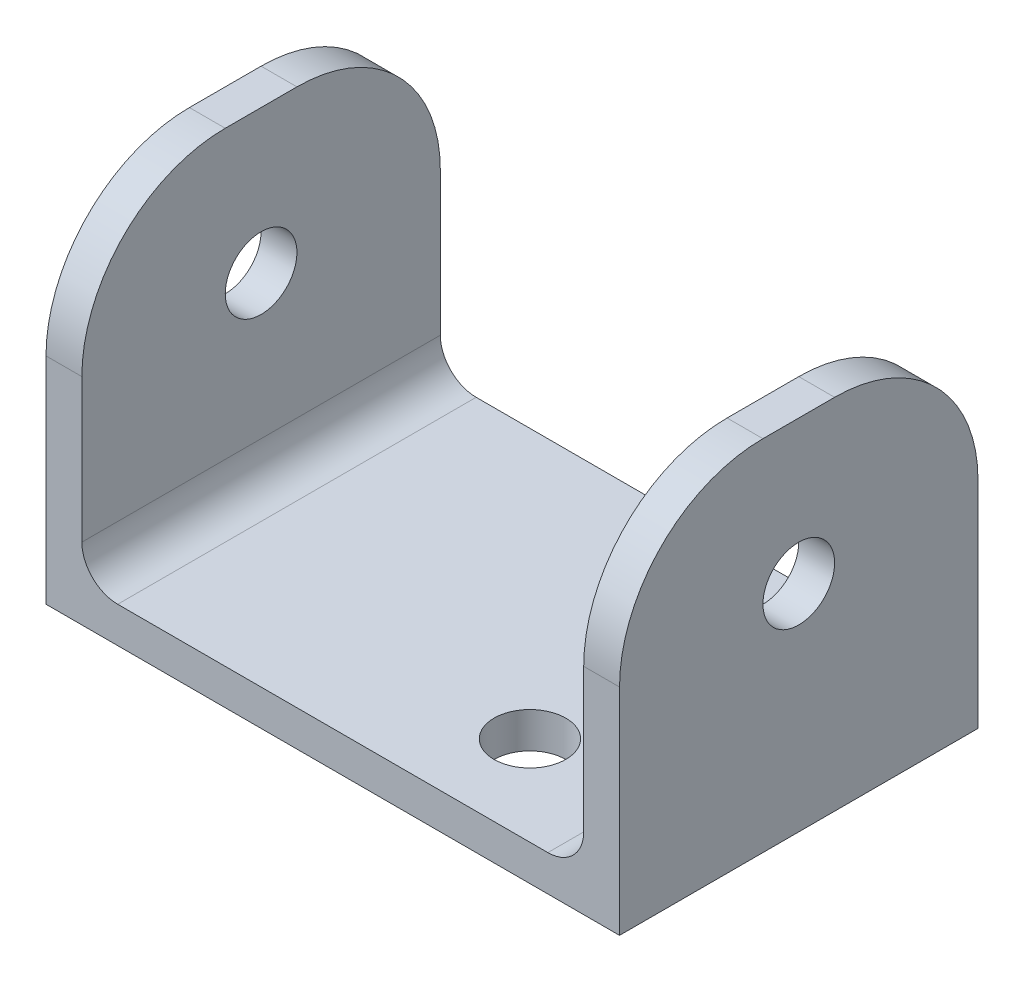
ISO-10303-21;
HEADER;
FILE_DESCRIPTION(('STEP AP214'),'2;1');
FILE_NAME('part.step','',(''),(''),'','','');
FILE_SCHEMA(('AUTOMOTIVE_DESIGN { 1 0 10303 214 1 1 1 1 }'));
ENDSEC;
DATA;
#1=APPLICATION_CONTEXT('core data for automotive mechanical design processes');
#2=APPLICATION_PROTOCOL_DEFINITION('international standard','automotive_design',2000,#1);
#3=PRODUCT_CONTEXT('',#1,'mechanical');
#4=PRODUCT('Part','Part','',(#3));
#5=PRODUCT_RELATED_PRODUCT_CATEGORY('part','',(#4));
#6=PRODUCT_DEFINITION_FORMATION('','',#4);
#7=PRODUCT_DEFINITION_CONTEXT('part definition',#1,'design');
#8=PRODUCT_DEFINITION('design','',#6,#7);
#9=PRODUCT_DEFINITION_SHAPE('','',#8);
#10=(LENGTH_UNIT() NAMED_UNIT(*) SI_UNIT(.MILLI.,.METRE.));
#11=(NAMED_UNIT(*) PLANE_ANGLE_UNIT() SI_UNIT($,.RADIAN.));
#12=(NAMED_UNIT(*) SI_UNIT($,.STERADIAN.) SOLID_ANGLE_UNIT());
#13=UNCERTAINTY_MEASURE_WITH_UNIT(LENGTH_MEASURE(1.E-05),#10,'distance_accuracy_value','');
#14=(GEOMETRIC_REPRESENTATION_CONTEXT(3) GLOBAL_UNCERTAINTY_ASSIGNED_CONTEXT((#13)) GLOBAL_UNIT_ASSIGNED_CONTEXT((#10,
#11,#12)) REPRESENTATION_CONTEXT('',''));
#15=CARTESIAN_POINT('',(0.,0.,0.));
#16=DIRECTION('',(0.,0.,1.));
#17=DIRECTION('',(1.,0.,0.));
#18=AXIS2_PLACEMENT_3D('',#15,#16,#17);
#19=CARTESIAN_POINT('',(-25.4,15.875,15.875));
#20=DIRECTION('',(0.,-1.,0.));
#21=DIRECTION('',(0.,0.,-1.));
#22=AXIS2_PLACEMENT_3D('',#19,#20,#21);
#23=PLANE('',#22);
#24=DIRECTION('',(0.,0.,-1.));
#25=VECTOR('',#24,1.);
#26=CARTESIAN_POINT('',(-25.4,15.875,15.875));
#27=LINE('',#26,#25);
#28=CARTESIAN_POINT('',(-25.4,15.875,3.175));
#29=VERTEX_POINT('',#28);
#30=CARTESIAN_POINT('',(-25.4,15.875,-3.175));
#31=VERTEX_POINT('',#30);
#32=EDGE_CURVE('E158',#29,#31,#27,.T.);
#33=ORIENTED_EDGE('',*,*,#32,.F.);
#34=DIRECTION('',(-1.,0.,0.));
#35=VECTOR('',#34,1.);
#36=CARTESIAN_POINT('',(-22.225,15.875,3.175));
#37=LINE('',#36,#35);
#38=CARTESIAN_POINT('',(-22.225,15.875,3.175));
#39=VERTEX_POINT('',#38);
#40=EDGE_CURVE('E214',#29,#39,#37,.F.);
#41=ORIENTED_EDGE('',*,*,#40,.T.);
#42=DIRECTION('',(0.,0.,1.));
#43=VECTOR('',#42,1.);
#44=CARTESIAN_POINT('',(-22.225,15.875,-15.875));
#45=LINE('',#44,#43);
#46=CARTESIAN_POINT('',(-22.225,15.875,-3.175));
#47=VERTEX_POINT('',#46);
#48=EDGE_CURVE('E170',#47,#39,#45,.T.);
#49=ORIENTED_EDGE('',*,*,#48,.F.);
#50=DIRECTION('',(-1.,0.,0.));
#51=VECTOR('',#50,1.);
#52=CARTESIAN_POINT('',(-25.4,15.875,-3.175));
#53=LINE('',#52,#51);
#54=EDGE_CURVE('E211',#47,#31,#53,.T.);
#55=ORIENTED_EDGE('',*,*,#54,.T.);
#56=EDGE_LOOP('',(#33,#41,#49,#55));
#57=FACE_BOUND('',#56,.T.);
#58=ADVANCED_FACE('F37',(#57),#23,.F.);
#59=CARTESIAN_POINT('',(25.4,15.875,15.875));
#60=DIRECTION('',(-1.,0.,0.));
#61=DIRECTION('',(0.,0.,1.));
#62=AXIS2_PLACEMENT_3D('',#59,#60,#61);
#63=PLANE('',#62);
#64=CARTESIAN_POINT('',(25.4,3.17500000000001,0.));
#65=DIRECTION('',(1.,0.,0.));
#66=DIRECTION('',(0.,1.,0.));
#67=AXIS2_PLACEMENT_3D('',#64,#65,#66);
#68=CIRCLE('',#67,3.175);
#69=CARTESIAN_POINT('',(25.4,6.35000000000001,0.));
#70=VERTEX_POINT('',#69);
#71=EDGE_CURVE('E276',#70,#70,#68,.T.);
#72=ORIENTED_EDGE('',*,*,#71,.F.);
#73=EDGE_LOOP('',(#72));
#74=FACE_BOUND('',#73,.T.);
#75=DIRECTION('',(0.,1.,0.));
#76=VECTOR('',#75,1.);
#77=CARTESIAN_POINT('',(25.4,15.875,-15.875));
#78=LINE('',#77,#76);
#79=CARTESIAN_POINT('',(25.4,-15.875,-15.875));
#80=VERTEX_POINT('',#79);
#81=CARTESIAN_POINT('',(25.4,3.175,-15.875));
#82=VERTEX_POINT('',#81);
#83=EDGE_CURVE('E168',#80,#82,#78,.T.);
#84=ORIENTED_EDGE('',*,*,#83,.T.);
#85=CARTESIAN_POINT('',(25.4,3.175,-3.175));
#86=DIRECTION('',(-1.,0.,0.));
#87=DIRECTION('',(0.,0.,1.));
#88=AXIS2_PLACEMENT_3D('',#85,#86,#87);
#89=CIRCLE('',#88,12.7);
#90=CARTESIAN_POINT('',(25.4,15.875,-3.175));
#91=VERTEX_POINT('',#90);
#92=EDGE_CURVE('E11',#82,#91,#89,.F.);
#93=ORIENTED_EDGE('',*,*,#92,.T.);
#94=DIRECTION('',(0.,0.,-1.));
#95=VECTOR('',#94,1.);
#96=CARTESIAN_POINT('',(25.4,15.875,15.875));
#97=LINE('',#96,#95);
#98=CARTESIAN_POINT('',(25.4,15.875,3.175));
#99=VERTEX_POINT('',#98);
#100=EDGE_CURVE('E176',#99,#91,#97,.T.);
#101=ORIENTED_EDGE('',*,*,#100,.F.);
#102=CARTESIAN_POINT('',(25.4,3.175,3.175));
#103=DIRECTION('',(-1.,0.,0.));
#104=DIRECTION('',(0.,0.,1.));
#105=AXIS2_PLACEMENT_3D('',#102,#103,#104);
#106=CIRCLE('',#105,12.7);
#107=CARTESIAN_POINT('',(25.4,3.175,15.875));
#108=VERTEX_POINT('',#107);
#109=EDGE_CURVE('E45',#99,#108,#106,.F.);
#110=ORIENTED_EDGE('',*,*,#109,.T.);
#111=DIRECTION('',(0.,1.,0.));
#112=VECTOR('',#111,1.);
#113=CARTESIAN_POINT('',(25.4,15.875,15.875));
#114=LINE('',#113,#112);
#115=CARTESIAN_POINT('',(25.4,-15.875,15.875));
#116=VERTEX_POINT('',#115);
#117=EDGE_CURVE('E149',#116,#108,#114,.T.);
#118=ORIENTED_EDGE('',*,*,#117,.F.);
#119=DIRECTION('',(0.,0.,-1.));
#120=VECTOR('',#119,1.);
#121=CARTESIAN_POINT('',(25.4,-15.875,15.875));
#122=LINE('',#121,#120);
#123=EDGE_CURVE('E159',#116,#80,#122,.T.);
#124=ORIENTED_EDGE('',*,*,#123,.T.);
#125=EDGE_LOOP('',(#84,#93,#101,#110,#118,#124));
#126=FACE_BOUND('',#125,.T.);
#127=ADVANCED_FACE('F232',(#74,#126),#63,.F.);
#128=ORIENTED_EDGE('',*,*,#100,.T.);
#129=DIRECTION('',(-1.,0.,0.));
#130=VECTOR('',#129,1.);
#131=CARTESIAN_POINT('',(-25.4,15.875,-3.175));
#132=LINE('',#131,#130);
#133=CARTESIAN_POINT('',(22.225,15.875,-3.175));
#134=VERTEX_POINT('',#133);
#135=EDGE_CURVE('E225',#91,#134,#132,.T.);
#136=ORIENTED_EDGE('',*,*,#135,.T.);
#137=DIRECTION('',(0.,0.,1.));
#138=VECTOR('',#137,1.);
#139=CARTESIAN_POINT('',(22.225,15.875,-15.875));
#140=LINE('',#139,#138);
#141=CARTESIAN_POINT('',(22.225,15.875,3.175));
#142=VERTEX_POINT('',#141);
#143=EDGE_CURVE('E240',#134,#142,#140,.T.);
#144=ORIENTED_EDGE('',*,*,#143,.T.);
#145=DIRECTION('',(-1.,0.,0.));
#146=VECTOR('',#145,1.);
#147=CARTESIAN_POINT('',(25.4,15.875,3.175));
#148=LINE('',#147,#146);
#149=EDGE_CURVE('E57',#142,#99,#148,.F.);
#150=ORIENTED_EDGE('',*,*,#149,.T.);
#151=EDGE_LOOP('',(#128,#136,#144,#150));
#152=FACE_BOUND('',#151,.T.);
#153=ADVANCED_FACE('F242',(#152),#23,.F.);
#154=CARTESIAN_POINT('',(-25.4,15.875,15.875));
#155=DIRECTION('',(1.,0.,0.));
#156=DIRECTION('',(0.,0.,-1.));
#157=AXIS2_PLACEMENT_3D('',#154,#155,#156);
#158=PLANE('',#157);
#159=CARTESIAN_POINT('',(-25.4,3.175,0.));
#160=DIRECTION('',(1.,0.,0.));
#161=DIRECTION('',(0.,1.,0.));
#162=AXIS2_PLACEMENT_3D('',#159,#160,#161);
#163=CIRCLE('',#162,3.175);
#164=CARTESIAN_POINT('',(-25.4,6.35,0.));
#165=VERTEX_POINT('',#164);
#166=EDGE_CURVE('E203',#165,#165,#163,.T.);
#167=ORIENTED_EDGE('',*,*,#166,.T.);
#168=EDGE_LOOP('',(#167));
#169=FACE_BOUND('',#168,.T.);
#170=DIRECTION('',(0.,-1.,0.));
#171=VECTOR('',#170,1.);
#172=CARTESIAN_POINT('',(-25.4,15.875,15.875));
#173=LINE('',#172,#171);
#174=CARTESIAN_POINT('',(-25.4,3.175,15.875));
#175=VERTEX_POINT('',#174);
#176=CARTESIAN_POINT('',(-25.4,-15.875,15.875));
#177=VERTEX_POINT('',#176);
#178=EDGE_CURVE('E138',#175,#177,#173,.T.);
#179=ORIENTED_EDGE('',*,*,#178,.F.);
#180=CARTESIAN_POINT('',(-25.4,3.175,3.175));
#181=DIRECTION('',(1.,0.,0.));
#182=DIRECTION('',(0.,0.,-1.));
#183=AXIS2_PLACEMENT_3D('',#180,#181,#182);
#184=CIRCLE('',#183,12.7);
#185=EDGE_CURVE('E209',#175,#29,#184,.F.);
#186=ORIENTED_EDGE('',*,*,#185,.T.);
#187=ORIENTED_EDGE('',*,*,#32,.T.);
#188=CARTESIAN_POINT('',(-25.4,3.175,-3.175));
#189=DIRECTION('',(1.,0.,0.));
#190=DIRECTION('',(0.,0.,-1.));
#191=AXIS2_PLACEMENT_3D('',#188,#189,#190);
#192=CIRCLE('',#191,12.7);
#193=CARTESIAN_POINT('',(-25.4,3.175,-15.875));
#194=VERTEX_POINT('',#193);
#195=EDGE_CURVE('E207',#31,#194,#192,.F.);
#196=ORIENTED_EDGE('',*,*,#195,.T.);
#197=DIRECTION('',(0.,-1.,0.));
#198=VECTOR('',#197,1.);
#199=CARTESIAN_POINT('',(-25.4,15.875,-15.875));
#200=LINE('',#199,#198);
#201=CARTESIAN_POINT('',(-25.4,-15.875,-15.875));
#202=VERTEX_POINT('',#201);
#203=EDGE_CURVE('E155',#194,#202,#200,.T.);
#204=ORIENTED_EDGE('',*,*,#203,.T.);
#205=DIRECTION('',(0.,0.,-1.));
#206=VECTOR('',#205,1.);
#207=CARTESIAN_POINT('',(-25.4,-15.875,15.875));
#208=LINE('',#207,#206);
#209=EDGE_CURVE('E152',#177,#202,#208,.T.);
#210=ORIENTED_EDGE('',*,*,#209,.F.);
#211=EDGE_LOOP('',(#179,#186,#187,#196,#204,#210));
#212=FACE_BOUND('',#211,.T.);
#213=ADVANCED_FACE('F153',(#169,#212),#158,.F.);
#214=CARTESIAN_POINT('',(-25.4,-15.875,15.875));
#215=DIRECTION('',(0.,1.,0.));
#216=DIRECTION('',(0.,0.,1.));
#217=AXIS2_PLACEMENT_3D('',#214,#215,#216);
#218=PLANE('',#217);
#219=CARTESIAN_POINT('',(9.52500000000001,-15.875,7.9375));
#220=DIRECTION('',(0.,1.,0.));
#221=DIRECTION('',(0.,0.,1.));
#222=AXIS2_PLACEMENT_3D('',#219,#220,#221);
#223=CIRCLE('',#222,3.175);
#224=CARTESIAN_POINT('',(9.52500000000001,-15.875,11.1125));
#225=VERTEX_POINT('',#224);
#226=EDGE_CURVE('E266',#225,#225,#223,.T.);
#227=ORIENTED_EDGE('',*,*,#226,.T.);
#228=EDGE_LOOP('',(#227));
#229=FACE_BOUND('',#228,.T.);
#230=CARTESIAN_POINT('',(9.52500000000001,-15.875,-7.9375));
#231=DIRECTION('',(0.,1.,0.));
#232=DIRECTION('',(0.,0.,1.));
#233=AXIS2_PLACEMENT_3D('',#230,#231,#232);
#234=CIRCLE('',#233,3.175);
#235=CARTESIAN_POINT('',(9.52500000000001,-15.875,-4.7625));
#236=VERTEX_POINT('',#235);
#237=EDGE_CURVE('E258',#236,#236,#234,.T.);
#238=ORIENTED_EDGE('',*,*,#237,.T.);
#239=EDGE_LOOP('',(#238));
#240=FACE_BOUND('',#239,.T.);
#241=DIRECTION('',(1.,0.,0.));
#242=VECTOR('',#241,1.);
#243=CARTESIAN_POINT('',(-25.4,-15.875,-15.875));
#244=LINE('',#243,#242);
#245=EDGE_CURVE('E172',#202,#80,#244,.T.);
#246=ORIENTED_EDGE('',*,*,#245,.T.);
#247=ORIENTED_EDGE('',*,*,#123,.F.);
#248=DIRECTION('',(1.,0.,0.));
#249=VECTOR('',#248,1.);
#250=CARTESIAN_POINT('',(-25.4,-15.875,15.875));
#251=LINE('',#250,#249);
#252=EDGE_CURVE('E144',#177,#116,#251,.T.);
#253=ORIENTED_EDGE('',*,*,#252,.F.);
#254=ORIENTED_EDGE('',*,*,#209,.T.);
#255=EDGE_LOOP('',(#246,#247,#253,#254));
#256=FACE_BOUND('',#255,.T.);
#257=ADVANCED_FACE('F161',(#229,#240,#256),#218,.F.);
#258=CARTESIAN_POINT('',(25.4,-15.875,15.875));
#259=DIRECTION('',(0.,0.,1.));
#260=DIRECTION('',(1.,0.,0.));
#261=AXIS2_PLACEMENT_3D('',#258,#259,#260);
#262=PLANE('',#261);
#263=DIRECTION('',(0.,-1.,0.));
#264=VECTOR('',#263,1.);
#265=CARTESIAN_POINT('',(-22.225,15.875,15.875));
#266=LINE('',#265,#264);
#267=CARTESIAN_POINT('',(-22.225,3.17500000000001,15.875));
#268=VERTEX_POINT('',#267);
#269=CARTESIAN_POINT('',(-22.225,-9.52499999999999,15.875));
#270=VERTEX_POINT('',#269);
#271=EDGE_CURVE('E257',#268,#270,#266,.T.);
#272=ORIENTED_EDGE('',*,*,#271,.F.);
#273=DIRECTION('',(-1.,0.,0.));
#274=VECTOR('',#273,1.);
#275=CARTESIAN_POINT('',(-25.4,3.175,15.875));
#276=LINE('',#275,#274);
#277=EDGE_CURVE('E147',#268,#175,#276,.T.);
#278=ORIENTED_EDGE('',*,*,#277,.T.);
#279=ORIENTED_EDGE('',*,*,#178,.T.);
#280=ORIENTED_EDGE('',*,*,#252,.T.);
#281=ORIENTED_EDGE('',*,*,#117,.T.);
#282=DIRECTION('',(-1.,0.,0.));
#283=VECTOR('',#282,1.);
#284=CARTESIAN_POINT('',(22.225,3.175,15.875));
#285=LINE('',#284,#283);
#286=CARTESIAN_POINT('',(22.225,3.17500000000001,15.875));
#287=VERTEX_POINT('',#286);
#288=EDGE_CURVE('E198',#108,#287,#285,.T.);
#289=ORIENTED_EDGE('',*,*,#288,.T.);
#290=DIRECTION('',(0.,1.,0.));
#291=VECTOR('',#290,1.);
#292=CARTESIAN_POINT('',(22.225,15.875,15.875));
#293=LINE('',#292,#291);
#294=CARTESIAN_POINT('',(22.225,-9.52499999999999,15.875));
#295=VERTEX_POINT('',#294);
#296=EDGE_CURVE('E241',#295,#287,#293,.T.);
#297=ORIENTED_EDGE('',*,*,#296,.F.);
#298=CARTESIAN_POINT('',(19.05,-9.525,15.875));
#299=DIRECTION('',(0.,0.,1.));
#300=DIRECTION('',(1.,0.,0.));
#301=AXIS2_PLACEMENT_3D('',#298,#299,#300);
#302=CIRCLE('',#301,3.175);
#303=CARTESIAN_POINT('',(19.05,-12.7,15.875));
#304=VERTEX_POINT('',#303);
#305=EDGE_CURVE('E194',#295,#304,#302,.F.);
#306=ORIENTED_EDGE('',*,*,#305,.T.);
#307=DIRECTION('',(1.,0.,0.));
#308=VECTOR('',#307,1.);
#309=CARTESIAN_POINT('',(-22.225,-12.7,15.875));
#310=LINE('',#309,#308);
#311=CARTESIAN_POINT('',(-19.05,-12.7,15.875));
#312=VERTEX_POINT('',#311);
#313=EDGE_CURVE('E254',#312,#304,#310,.T.);
#314=ORIENTED_EDGE('',*,*,#313,.F.);
#315=CARTESIAN_POINT('',(-19.05,-9.525,15.875));
#316=DIRECTION('',(0.,0.,1.));
#317=DIRECTION('',(1.,0.,0.));
#318=AXIS2_PLACEMENT_3D('',#315,#316,#317);
#319=CIRCLE('',#318,3.175);
#320=EDGE_CURVE('E189',#312,#270,#319,.F.);
#321=ORIENTED_EDGE('',*,*,#320,.T.);
#322=EDGE_LOOP('',(#272,#278,#279,#280,#281,#289,#297,#306,#314,#321));
#323=FACE_BOUND('',#322,.T.);
#324=ADVANCED_FACE('F141',(#323),#262,.T.);
#325=CARTESIAN_POINT('',(25.4,-15.875,-15.875));
#326=DIRECTION('',(0.,0.,1.));
#327=DIRECTION('',(1.,0.,0.));
#328=AXIS2_PLACEMENT_3D('',#325,#326,#327);
#329=PLANE('',#328);
#330=ORIENTED_EDGE('',*,*,#203,.F.);
#331=DIRECTION('',(-1.,0.,0.));
#332=VECTOR('',#331,1.);
#333=CARTESIAN_POINT('',(25.4,3.175,-15.875));
#334=LINE('',#333,#332);
#335=CARTESIAN_POINT('',(-22.225,3.17500000000001,-15.875));
#336=VERTEX_POINT('',#335);
#337=EDGE_CURVE('E222',#194,#336,#334,.F.);
#338=ORIENTED_EDGE('',*,*,#337,.T.);
#339=DIRECTION('',(0.,-1.,0.));
#340=VECTOR('',#339,1.);
#341=CARTESIAN_POINT('',(-22.225,15.875,-15.875));
#342=LINE('',#341,#340);
#343=CARTESIAN_POINT('',(-22.225,-9.52499999999999,-15.875));
#344=VERTEX_POINT('',#343);
#345=EDGE_CURVE('E253',#336,#344,#342,.T.);
#346=ORIENTED_EDGE('',*,*,#345,.T.);
#347=CARTESIAN_POINT('',(-19.05,-9.525,-15.875));
#348=DIRECTION('',(0.,0.,1.));
#349=DIRECTION('',(1.,0.,0.));
#350=AXIS2_PLACEMENT_3D('',#347,#348,#349);
#351=CIRCLE('',#350,3.175);
#352=CARTESIAN_POINT('',(-19.05,-12.7,-15.875));
#353=VERTEX_POINT('',#352);
#354=EDGE_CURVE('E192',#344,#353,#351,.T.);
#355=ORIENTED_EDGE('',*,*,#354,.T.);
#356=DIRECTION('',(1.,0.,0.));
#357=VECTOR('',#356,1.);
#358=CARTESIAN_POINT('',(-22.225,-12.7,-15.875));
#359=LINE('',#358,#357);
#360=CARTESIAN_POINT('',(19.05,-12.7,-15.875));
#361=VERTEX_POINT('',#360);
#362=EDGE_CURVE('E249',#353,#361,#359,.T.);
#363=ORIENTED_EDGE('',*,*,#362,.T.);
#364=CARTESIAN_POINT('',(19.05,-9.525,-15.875));
#365=DIRECTION('',(0.,0.,1.));
#366=DIRECTION('',(1.,0.,0.));
#367=AXIS2_PLACEMENT_3D('',#364,#365,#366);
#368=CIRCLE('',#367,3.175);
#369=CARTESIAN_POINT('',(22.225,-9.52499999999999,-15.875));
#370=VERTEX_POINT('',#369);
#371=EDGE_CURVE('E196',#361,#370,#368,.T.);
#372=ORIENTED_EDGE('',*,*,#371,.T.);
#373=DIRECTION('',(0.,1.,0.));
#374=VECTOR('',#373,1.);
#375=CARTESIAN_POINT('',(22.225,15.875,-15.875));
#376=LINE('',#375,#374);
#377=CARTESIAN_POINT('',(22.225,3.17500000000001,-15.875));
#378=VERTEX_POINT('',#377);
#379=EDGE_CURVE('E244',#370,#378,#376,.T.);
#380=ORIENTED_EDGE('',*,*,#379,.T.);
#381=DIRECTION('',(-1.,0.,0.));
#382=VECTOR('',#381,1.);
#383=CARTESIAN_POINT('',(25.4,3.175,-15.875));
#384=LINE('',#383,#382);
#385=EDGE_CURVE('E220',#378,#82,#384,.F.);
#386=ORIENTED_EDGE('',*,*,#385,.T.);
#387=ORIENTED_EDGE('',*,*,#83,.F.);
#388=ORIENTED_EDGE('',*,*,#245,.F.);
#389=EDGE_LOOP('',(#330,#338,#346,#355,#363,#372,#380,#386,#387,#388));
#390=FACE_BOUND('',#389,.T.);
#391=ADVANCED_FACE('F294',(#390),#329,.F.);
#392=CARTESIAN_POINT('',(-22.225,15.875,-15.875));
#393=DIRECTION('',(-1.,0.,0.));
#394=DIRECTION('',(0.,0.,1.));
#395=AXIS2_PLACEMENT_3D('',#392,#393,#394);
#396=PLANE('',#395);
#397=CARTESIAN_POINT('',(-22.225,3.175,0.));
#398=DIRECTION('',(-1.,0.,0.));
#399=DIRECTION('',(0.,0.,1.));
#400=AXIS2_PLACEMENT_3D('',#397,#398,#399);
#401=CIRCLE('',#400,3.175);
#402=CARTESIAN_POINT('',(-22.225,3.175,3.175));
#403=VERTEX_POINT('',#402);
#404=EDGE_CURVE('E202',#403,#403,#401,.T.);
#405=ORIENTED_EDGE('',*,*,#404,.T.);
#406=EDGE_LOOP('',(#405));
#407=FACE_BOUND('',#406,.T.);
#408=ORIENTED_EDGE('',*,*,#48,.T.);
#409=CARTESIAN_POINT('',(-22.225,3.175,3.175));
#410=DIRECTION('',(-1.,0.,0.));
#411=DIRECTION('',(0.,0.,1.));
#412=AXIS2_PLACEMENT_3D('',#409,#410,#411);
#413=CIRCLE('',#412,12.7);
#414=EDGE_CURVE('E218',#39,#268,#413,.F.);
#415=ORIENTED_EDGE('',*,*,#414,.T.);
#416=ORIENTED_EDGE('',*,*,#271,.T.);
#417=DIRECTION('',(0.,0.,1.));
#418=VECTOR('',#417,1.);
#419=CARTESIAN_POINT('',(-22.225,-9.525,-15.875));
#420=LINE('',#419,#418);
#421=EDGE_CURVE('E183',#270,#344,#420,.F.);
#422=ORIENTED_EDGE('',*,*,#421,.T.);
#423=ORIENTED_EDGE('',*,*,#345,.F.);
#424=CARTESIAN_POINT('',(-22.225,3.175,-3.175));
#425=DIRECTION('',(-1.,0.,0.));
#426=DIRECTION('',(0.,0.,1.));
#427=AXIS2_PLACEMENT_3D('',#424,#425,#426);
#428=CIRCLE('',#427,12.7);
#429=EDGE_CURVE('E216',#336,#47,#428,.F.);
#430=ORIENTED_EDGE('',*,*,#429,.T.);
#431=EDGE_LOOP('',(#408,#415,#416,#422,#423,#430));
#432=FACE_BOUND('',#431,.T.);
#433=ADVANCED_FACE('F291',(#407,#432),#396,.F.);
#434=CARTESIAN_POINT('',(22.225,15.875,-15.875));
#435=DIRECTION('',(1.,0.,0.));
#436=DIRECTION('',(0.,0.,-1.));
#437=AXIS2_PLACEMENT_3D('',#434,#435,#436);
#438=PLANE('',#437);
#439=CARTESIAN_POINT('',(22.225,3.17500000000001,0.));
#440=DIRECTION('',(1.,0.,0.));
#441=DIRECTION('',(0.,0.,-1.));
#442=AXIS2_PLACEMENT_3D('',#439,#440,#441);
#443=CIRCLE('',#442,3.175);
#444=CARTESIAN_POINT('',(22.225,3.17500000000001,-3.175));
#445=VERTEX_POINT('',#444);
#446=EDGE_CURVE('E199',#445,#445,#443,.T.);
#447=ORIENTED_EDGE('',*,*,#446,.T.);
#448=EDGE_LOOP('',(#447));
#449=FACE_BOUND('',#448,.T.);
#450=ORIENTED_EDGE('',*,*,#143,.F.);
#451=CARTESIAN_POINT('',(22.225,3.175,-3.175));
#452=DIRECTION('',(1.,0.,0.));
#453=DIRECTION('',(0.,0.,-1.));
#454=AXIS2_PLACEMENT_3D('',#451,#452,#453);
#455=CIRCLE('',#454,12.7);
#456=EDGE_CURVE('E230',#134,#378,#455,.F.);
#457=ORIENTED_EDGE('',*,*,#456,.T.);
#458=ORIENTED_EDGE('',*,*,#379,.F.);
#459=DIRECTION('',(0.,0.,1.));
#460=VECTOR('',#459,1.);
#461=CARTESIAN_POINT('',(22.225,-9.525,15.875));
#462=LINE('',#461,#460);
#463=EDGE_CURVE('E186',#370,#295,#462,.T.);
#464=ORIENTED_EDGE('',*,*,#463,.T.);
#465=ORIENTED_EDGE('',*,*,#296,.T.);
#466=CARTESIAN_POINT('',(22.225,3.175,3.175));
#467=DIRECTION('',(1.,0.,0.));
#468=DIRECTION('',(0.,0.,-1.));
#469=AXIS2_PLACEMENT_3D('',#466,#467,#468);
#470=CIRCLE('',#469,12.7);
#471=EDGE_CURVE('E228',#287,#142,#470,.F.);
#472=ORIENTED_EDGE('',*,*,#471,.T.);
#473=EDGE_LOOP('',(#450,#457,#458,#464,#465,#472));
#474=FACE_BOUND('',#473,.T.);
#475=ADVANCED_FACE('F239',(#449,#474),#438,.F.);
#476=CARTESIAN_POINT('',(-22.225,-12.7,-15.875));
#477=DIRECTION('',(0.,-1.,0.));
#478=DIRECTION('',(0.,0.,-1.));
#479=AXIS2_PLACEMENT_3D('',#476,#477,#478);
#480=PLANE('',#479);
#481=CARTESIAN_POINT('',(9.52500000000001,-12.7,7.9375));
#482=DIRECTION('',(0.,1.,0.));
#483=DIRECTION('',(0.,0.,1.));
#484=AXIS2_PLACEMENT_3D('',#481,#482,#483);
#485=CIRCLE('',#484,3.175);
#486=CARTESIAN_POINT('',(9.52500000000001,-12.7,11.1125));
#487=VERTEX_POINT('',#486);
#488=EDGE_CURVE('E269',#487,#487,#485,.T.);
#489=ORIENTED_EDGE('',*,*,#488,.F.);
#490=EDGE_LOOP('',(#489));
#491=FACE_BOUND('',#490,.T.);
#492=CARTESIAN_POINT('',(9.52500000000001,-12.7,-7.9375));
#493=DIRECTION('',(0.,1.,0.));
#494=DIRECTION('',(0.,0.,1.));
#495=AXIS2_PLACEMENT_3D('',#492,#493,#494);
#496=CIRCLE('',#495,3.175);
#497=CARTESIAN_POINT('',(9.52500000000001,-12.7,-4.7625));
#498=VERTEX_POINT('',#497);
#499=EDGE_CURVE('E263',#498,#498,#496,.T.);
#500=ORIENTED_EDGE('',*,*,#499,.F.);
#501=EDGE_LOOP('',(#500));
#502=FACE_BOUND('',#501,.T.);
#503=ORIENTED_EDGE('',*,*,#362,.F.);
#504=DIRECTION('',(0.,0.,1.));
#505=VECTOR('',#504,1.);
#506=CARTESIAN_POINT('',(-19.05,-12.7,15.875));
#507=LINE('',#506,#505);
#508=EDGE_CURVE('E180',#353,#312,#507,.T.);
#509=ORIENTED_EDGE('',*,*,#508,.T.);
#510=ORIENTED_EDGE('',*,*,#313,.T.);
#511=DIRECTION('',(0.,0.,1.));
#512=VECTOR('',#511,1.);
#513=CARTESIAN_POINT('',(19.05,-12.7,-15.875));
#514=LINE('',#513,#512);
#515=EDGE_CURVE('E178',#304,#361,#514,.F.);
#516=ORIENTED_EDGE('',*,*,#515,.T.);
#517=EDGE_LOOP('',(#503,#509,#510,#516));
#518=FACE_BOUND('',#517,.T.);
#519=ADVANCED_FACE('F322',(#491,#502,#518),#480,.F.);
#520=CARTESIAN_POINT('',(9.52500000000001,-15.875,-7.9375));
#521=DIRECTION('',(0.,1.,0.));
#522=DIRECTION('',(0.,0.,1.));
#523=AXIS2_PLACEMENT_3D('',#520,#521,#522);
#524=CYLINDRICAL_SURFACE('',#523,3.175);
#525=ORIENTED_EDGE('',*,*,#237,.F.);
#526=EDGE_LOOP('',(#525));
#527=FACE_BOUND('',#526,.T.);
#528=ORIENTED_EDGE('',*,*,#499,.T.);
#529=EDGE_LOOP('',(#528));
#530=FACE_BOUND('',#529,.T.);
#531=ADVANCED_FACE('F336',(#527,#530),#524,.F.);
#532=CARTESIAN_POINT('',(9.52500000000001,-15.875,7.9375));
#533=DIRECTION('',(0.,1.,0.));
#534=DIRECTION('',(0.,0.,1.));
#535=AXIS2_PLACEMENT_3D('',#532,#533,#534);
#536=CYLINDRICAL_SURFACE('',#535,3.175);
#537=ORIENTED_EDGE('',*,*,#226,.F.);
#538=EDGE_LOOP('',(#537));
#539=FACE_BOUND('',#538,.T.);
#540=ORIENTED_EDGE('',*,*,#488,.T.);
#541=EDGE_LOOP('',(#540));
#542=FACE_BOUND('',#541,.T.);
#543=ADVANCED_FACE('F329',(#539,#542),#536,.F.);
#544=CARTESIAN_POINT('',(-19.05,-9.525,-15.875));
#545=DIRECTION('',(0.,0.,-1.));
#546=DIRECTION('',(-1.,0.,0.));
#547=AXIS2_PLACEMENT_3D('',#544,#545,#546);
#548=CYLINDRICAL_SURFACE('',#547,3.175);
#549=ORIENTED_EDGE('',*,*,#354,.F.);
#550=ORIENTED_EDGE('',*,*,#421,.F.);
#551=ORIENTED_EDGE('',*,*,#320,.F.);
#552=ORIENTED_EDGE('',*,*,#508,.F.);
#553=EDGE_LOOP('',(#549,#550,#551,#552));
#554=FACE_BOUND('',#553,.T.);
#555=ADVANCED_FACE('F326',(#554),#548,.F.);
#556=CARTESIAN_POINT('',(19.05,-9.525,-15.875));
#557=DIRECTION('',(0.,0.,-1.));
#558=DIRECTION('',(-1.,0.,0.));
#559=AXIS2_PLACEMENT_3D('',#556,#557,#558);
#560=CYLINDRICAL_SURFACE('',#559,3.175);
#561=ORIENTED_EDGE('',*,*,#371,.F.);
#562=ORIENTED_EDGE('',*,*,#515,.F.);
#563=ORIENTED_EDGE('',*,*,#305,.F.);
#564=ORIENTED_EDGE('',*,*,#463,.F.);
#565=EDGE_LOOP('',(#561,#562,#563,#564));
#566=FACE_BOUND('',#565,.T.);
#567=ADVANCED_FACE('F319',(#566),#560,.F.);
#568=CARTESIAN_POINT('',(-25.4,3.175,0.));
#569=DIRECTION('',(1.,0.,0.));
#570=DIRECTION('',(0.,1.,0.));
#571=AXIS2_PLACEMENT_3D('',#568,#569,#570);
#572=CYLINDRICAL_SURFACE('',#571,3.175);
#573=ORIENTED_EDGE('',*,*,#71,.T.);
#574=EDGE_LOOP('',(#573));
#575=FACE_BOUND('',#574,.T.);
#576=ORIENTED_EDGE('',*,*,#446,.F.);
#577=EDGE_LOOP('',(#576));
#578=FACE_BOUND('',#577,.T.);
#579=ADVANCED_FACE('F287',(#575,#578),#572,.F.);
#580=ORIENTED_EDGE('',*,*,#166,.F.);
#581=EDGE_LOOP('',(#580));
#582=FACE_BOUND('',#581,.T.);
#583=ORIENTED_EDGE('',*,*,#404,.F.);
#584=EDGE_LOOP('',(#583));
#585=FACE_BOUND('',#584,.T.);
#586=ADVANCED_FACE('F283',(#582,#585),#572,.F.);
#587=CARTESIAN_POINT('',(25.4,3.175,3.175));
#588=DIRECTION('',(1.,0.,0.));
#589=DIRECTION('',(0.,0.,-1.));
#590=AXIS2_PLACEMENT_3D('',#587,#588,#589);
#591=CYLINDRICAL_SURFACE('',#590,12.7);
#592=ORIENTED_EDGE('',*,*,#414,.F.);
#593=ORIENTED_EDGE('',*,*,#40,.F.);
#594=ORIENTED_EDGE('',*,*,#185,.F.);
#595=ORIENTED_EDGE('',*,*,#277,.F.);
#596=EDGE_LOOP('',(#592,#593,#594,#595));
#597=FACE_BOUND('',#596,.T.);
#598=ADVANCED_FACE('F286',(#597),#591,.T.);
#599=CARTESIAN_POINT('',(-25.4,3.175,-3.175));
#600=DIRECTION('',(-1.,0.,0.));
#601=DIRECTION('',(0.,0.,1.));
#602=AXIS2_PLACEMENT_3D('',#599,#600,#601);
#603=CYLINDRICAL_SURFACE('',#602,12.7);
#604=ORIENTED_EDGE('',*,*,#429,.F.);
#605=ORIENTED_EDGE('',*,*,#337,.F.);
#606=ORIENTED_EDGE('',*,*,#195,.F.);
#607=ORIENTED_EDGE('',*,*,#54,.F.);
#608=EDGE_LOOP('',(#604,#605,#606,#607));
#609=FACE_BOUND('',#608,.T.);
#610=ADVANCED_FACE('F306',(#609),#603,.T.);
#611=CARTESIAN_POINT('',(-25.4,3.175,-3.175));
#612=DIRECTION('',(-1.,0.,0.));
#613=DIRECTION('',(0.,0.,1.));
#614=AXIS2_PLACEMENT_3D('',#611,#612,#613);
#615=CYLINDRICAL_SURFACE('',#614,12.7);
#616=ORIENTED_EDGE('',*,*,#92,.F.);
#617=ORIENTED_EDGE('',*,*,#385,.F.);
#618=ORIENTED_EDGE('',*,*,#456,.F.);
#619=ORIENTED_EDGE('',*,*,#135,.F.);
#620=EDGE_LOOP('',(#616,#617,#618,#619));
#621=FACE_BOUND('',#620,.T.);
#622=ADVANCED_FACE('F312',(#621),#615,.T.);
#623=CARTESIAN_POINT('',(25.4,3.175,3.175));
#624=DIRECTION('',(1.,0.,0.));
#625=DIRECTION('',(0.,0.,-1.));
#626=AXIS2_PLACEMENT_3D('',#623,#624,#625);
#627=CYLINDRICAL_SURFACE('',#626,12.7);
#628=ORIENTED_EDGE('',*,*,#109,.F.);
#629=ORIENTED_EDGE('',*,*,#149,.F.);
#630=ORIENTED_EDGE('',*,*,#471,.F.);
#631=ORIENTED_EDGE('',*,*,#288,.F.);
#632=EDGE_LOOP('',(#628,#629,#630,#631));
#633=FACE_BOUND('',#632,.T.);
#634=ADVANCED_FACE('F39',(#633),#627,.T.);
#635=CLOSED_SHELL('',(#58,#127,#153,#213,#257,#324,#391,#433,#475,#519,#531,#543,#555,#567,#579,
#586,#598,#610,#622,#634));
#636=MANIFOLD_SOLID_BREP('B2',#635);
#637=ADVANCED_BREP_SHAPE_REPRESENTATION('',(#18,#636),#14);
#638=SHAPE_DEFINITION_REPRESENTATION(#9,#637);
ENDSEC;
END-ISO-10303-21;
